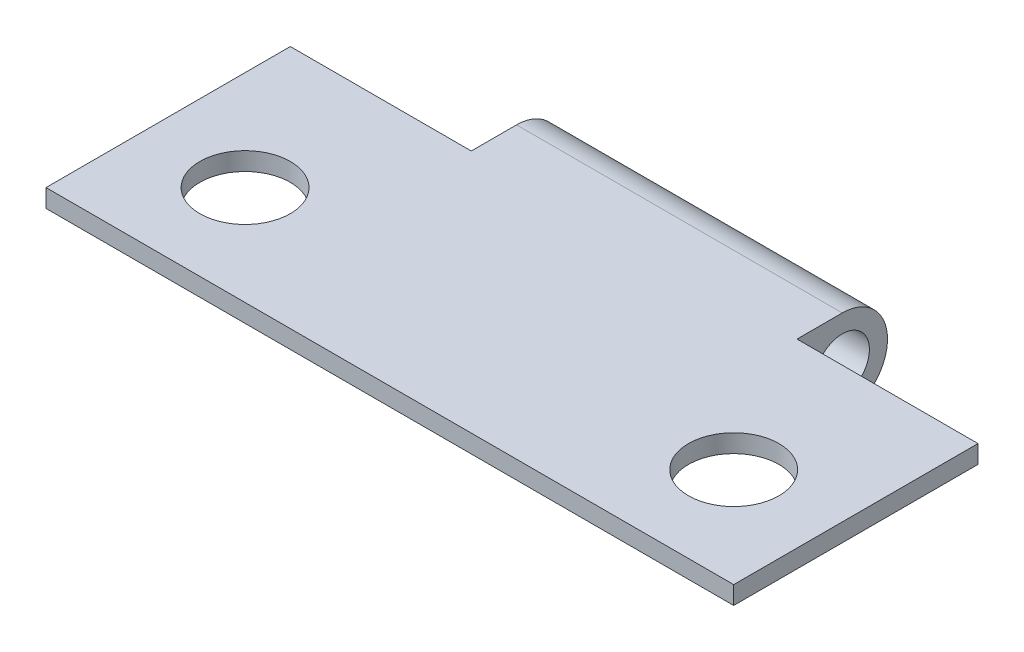
ISO-10303-21;
HEADER;
FILE_DESCRIPTION(('STEP AP214'),'2;1');
FILE_NAME('part.step','',(''),(''),'','','');
FILE_SCHEMA(('AUTOMOTIVE_DESIGN { 1 0 10303 214 1 1 1 1 }'));
ENDSEC;
DATA;
#1=APPLICATION_CONTEXT('core data for automotive mechanical design processes');
#2=APPLICATION_PROTOCOL_DEFINITION('international standard','automotive_design',2000,#1);
#3=PRODUCT_CONTEXT('',#1,'mechanical');
#4=PRODUCT('Part','Part','',(#3));
#5=PRODUCT_RELATED_PRODUCT_CATEGORY('part','',(#4));
#6=PRODUCT_DEFINITION_FORMATION('','',#4);
#7=PRODUCT_DEFINITION_CONTEXT('part definition',#1,'design');
#8=PRODUCT_DEFINITION('design','',#6,#7);
#9=PRODUCT_DEFINITION_SHAPE('','',#8);
#10=(LENGTH_UNIT() NAMED_UNIT(*) SI_UNIT(.MILLI.,.METRE.));
#11=(NAMED_UNIT(*) PLANE_ANGLE_UNIT() SI_UNIT($,.RADIAN.));
#12=(NAMED_UNIT(*) SI_UNIT($,.STERADIAN.) SOLID_ANGLE_UNIT());
#13=UNCERTAINTY_MEASURE_WITH_UNIT(LENGTH_MEASURE(1.E-05),#10,'distance_accuracy_value','');
#14=(GEOMETRIC_REPRESENTATION_CONTEXT(3) GLOBAL_UNCERTAINTY_ASSIGNED_CONTEXT((#13)) GLOBAL_UNIT_ASSIGNED_CONTEXT((#10,
#11,#12)) REPRESENTATION_CONTEXT('',''));
#15=CARTESIAN_POINT('',(0.,0.,0.));
#16=DIRECTION('',(0.,0.,1.));
#17=DIRECTION('',(1.,0.,0.));
#18=AXIS2_PLACEMENT_3D('',#15,#16,#17);
#19=CARTESIAN_POINT('',(38.,-1.50000000000001,-16.));
#20=DIRECTION('',(-1.,0.,0.));
#21=DIRECTION('',(0.,0.,1.));
#22=AXIS2_PLACEMENT_3D('',#19,#20,#21);
#23=PLANE('',#22);
#24=DIRECTION('',(0.,0.,-1.));
#25=VECTOR('',#24,1.);
#26=CARTESIAN_POINT('',(38.,0.,0.));
#27=LINE('',#26,#25);
#28=CARTESIAN_POINT('',(38.,0.,0.));
#29=VERTEX_POINT('',#28);
#30=CARTESIAN_POINT('',(38.,0.,-13.5));
#31=VERTEX_POINT('',#30);
#32=EDGE_CURVE('E128',#29,#31,#27,.T.);
#33=ORIENTED_EDGE('',*,*,#32,.T.);
#34=DIRECTION('',(0.,1.,0.));
#35=VECTOR('',#34,1.);
#36=CARTESIAN_POINT('',(38.,-4.00000000000002,-13.5));
#37=LINE('',#36,#35);
#38=CARTESIAN_POINT('',(38.,0.999999999999999,-13.5));
#39=VERTEX_POINT('',#38);
#40=EDGE_CURVE('E141',#31,#39,#37,.T.);
#41=ORIENTED_EDGE('',*,*,#40,.T.);
#42=DIRECTION('',(0.,0.,1.));
#43=VECTOR('',#42,1.);
#44=CARTESIAN_POINT('',(38.,0.999999999999999,-16.));
#45=LINE('',#44,#43);
#46=CARTESIAN_POINT('',(38.,1.,0.));
#47=VERTEX_POINT('',#46);
#48=EDGE_CURVE('E136',#39,#47,#45,.T.);
#49=ORIENTED_EDGE('',*,*,#48,.T.);
#50=DIRECTION('',(0.,-1.,0.));
#51=VECTOR('',#50,1.);
#52=CARTESIAN_POINT('',(38.,0.,0.));
#53=LINE('',#52,#51);
#54=EDGE_CURVE('E124',#47,#29,#53,.T.);
#55=ORIENTED_EDGE('',*,*,#54,.T.);
#56=EDGE_LOOP('',(#33,#41,#49,#55));
#57=FACE_BOUND('',#56,.T.);
#58=ADVANCED_FACE('F33',(#57),#23,.F.);
#59=CARTESIAN_POINT('',(0.,-1.50000000000001,-16.));
#60=DIRECTION('',(-1.,0.,0.));
#61=DIRECTION('',(0.,0.,1.));
#62=AXIS2_PLACEMENT_3D('',#59,#60,#61);
#63=PLANE('',#62);
#64=DIRECTION('',(0.,1.,0.));
#65=VECTOR('',#64,1.);
#66=CARTESIAN_POINT('',(0.,-4.00000000000002,-13.5));
#67=LINE('',#66,#65);
#68=CARTESIAN_POINT('',(0.,0.,-13.5));
#69=VERTEX_POINT('',#68);
#70=CARTESIAN_POINT('',(0.,0.999999999999999,-13.5));
#71=VERTEX_POINT('',#70);
#72=EDGE_CURVE('E100',#69,#71,#67,.T.);
#73=ORIENTED_EDGE('',*,*,#72,.F.);
#74=DIRECTION('',(0.,0.,-1.));
#75=VECTOR('',#74,1.);
#76=CARTESIAN_POINT('',(0.,0.,0.));
#77=LINE('',#76,#75);
#78=CARTESIAN_POINT('',(0.,0.,0.));
#79=VERTEX_POINT('',#78);
#80=EDGE_CURVE('E125',#79,#69,#77,.T.);
#81=ORIENTED_EDGE('',*,*,#80,.F.);
#82=DIRECTION('',(0.,-1.,0.));
#83=VECTOR('',#82,1.);
#84=CARTESIAN_POINT('',(0.,0.,0.));
#85=LINE('',#84,#83);
#86=CARTESIAN_POINT('',(0.,1.,0.));
#87=VERTEX_POINT('',#86);
#88=EDGE_CURVE('E123',#87,#79,#85,.T.);
#89=ORIENTED_EDGE('',*,*,#88,.F.);
#90=DIRECTION('',(0.,0.,1.));
#91=VECTOR('',#90,1.);
#92=CARTESIAN_POINT('',(0.,0.999999999999999,-16.));
#93=LINE('',#92,#91);
#94=EDGE_CURVE('E113',#71,#87,#93,.T.);
#95=ORIENTED_EDGE('',*,*,#94,.F.);
#96=EDGE_LOOP('',(#73,#81,#89,#95));
#97=FACE_BOUND('',#96,.T.);
#98=ADVANCED_FACE('F121',(#97),#63,.T.);
#99=CARTESIAN_POINT('',(38.,0.,0.));
#100=DIRECTION('',(0.,0.,-1.));
#101=DIRECTION('',(-1.,0.,0.));
#102=AXIS2_PLACEMENT_3D('',#99,#100,#101);
#103=PLANE('',#102);
#104=ORIENTED_EDGE('',*,*,#88,.T.);
#105=DIRECTION('',(-1.,0.,0.));
#106=VECTOR('',#105,1.);
#107=CARTESIAN_POINT('',(38.,0.,0.));
#108=LINE('',#107,#106);
#109=EDGE_CURVE('E11',#29,#79,#108,.T.);
#110=ORIENTED_EDGE('',*,*,#109,.F.);
#111=ORIENTED_EDGE('',*,*,#54,.F.);
#112=DIRECTION('',(-1.,0.,0.));
#113=VECTOR('',#112,1.);
#114=CARTESIAN_POINT('',(38.,1.,0.));
#115=LINE('',#114,#113);
#116=EDGE_CURVE('E133',#47,#87,#115,.T.);
#117=ORIENTED_EDGE('',*,*,#116,.T.);
#118=EDGE_LOOP('',(#104,#110,#111,#117));
#119=FACE_BOUND('',#118,.T.);
#120=ADVANCED_FACE('F35',(#119),#103,.F.);
#121=CARTESIAN_POINT('',(38.,0.,0.));
#122=DIRECTION('',(0.,1.,0.));
#123=DIRECTION('',(0.,0.,1.));
#124=AXIS2_PLACEMENT_3D('',#121,#122,#123);
#125=PLANE('',#124);
#126=CARTESIAN_POINT('',(32.5,0.,-5.5));
#127=DIRECTION('',(0.,1.,0.));
#128=DIRECTION('',(0.,0.,1.));
#129=AXIS2_PLACEMENT_3D('',#126,#127,#128);
#130=CIRCLE('',#129,2.5);
#131=CARTESIAN_POINT('',(32.5,0.,-3.));
#132=VERTEX_POINT('',#131);
#133=EDGE_CURVE('E190',#132,#132,#130,.T.);
#134=ORIENTED_EDGE('',*,*,#133,.T.);
#135=EDGE_LOOP('',(#134));
#136=FACE_BOUND('',#135,.T.);
#137=CARTESIAN_POINT('',(5.5,0.,-5.5));
#138=DIRECTION('',(0.,1.,0.));
#139=DIRECTION('',(0.,0.,1.));
#140=AXIS2_PLACEMENT_3D('',#137,#138,#139);
#141=CIRCLE('',#140,2.5);
#142=CARTESIAN_POINT('',(5.5,0.,-3.));
#143=VERTEX_POINT('',#142);
#144=EDGE_CURVE('E118',#143,#143,#141,.T.);
#145=ORIENTED_EDGE('',*,*,#144,.T.);
#146=EDGE_LOOP('',(#145));
#147=FACE_BOUND('',#146,.T.);
#148=ORIENTED_EDGE('',*,*,#80,.T.);
#149=DIRECTION('',(1.,0.,0.));
#150=VECTOR('',#149,1.);
#151=CARTESIAN_POINT('',(38.,0.,-13.5));
#152=LINE('',#151,#150);
#153=CARTESIAN_POINT('',(10.,0.,-13.5));
#154=VERTEX_POINT('',#153);
#155=EDGE_CURVE('E103',#69,#154,#152,.T.);
#156=ORIENTED_EDGE('',*,*,#155,.T.);
#157=DIRECTION('',(0.,0.,-1.));
#158=VECTOR('',#157,1.);
#159=CARTESIAN_POINT('',(10.,0.,0.));
#160=LINE('',#159,#158);
#161=CARTESIAN_POINT('',(10.,0.,-14.));
#162=VERTEX_POINT('',#161);
#163=EDGE_CURVE('E176',#154,#162,#160,.T.);
#164=ORIENTED_EDGE('',*,*,#163,.T.);
#165=DIRECTION('',(-1.,0.,0.));
#166=VECTOR('',#165,1.);
#167=CARTESIAN_POINT('',(38.,0.,-14.));
#168=LINE('',#167,#166);
#169=CARTESIAN_POINT('',(28.,0.,-14.));
#170=VERTEX_POINT('',#169);
#171=EDGE_CURVE('E42',#170,#162,#168,.T.);
#172=ORIENTED_EDGE('',*,*,#171,.F.);
#173=DIRECTION('',(0.,0.,1.));
#174=VECTOR('',#173,1.);
#175=CARTESIAN_POINT('',(28.,0.,0.));
#176=LINE('',#175,#174);
#177=CARTESIAN_POINT('',(28.,0.,-13.5));
#178=VERTEX_POINT('',#177);
#179=EDGE_CURVE('E144',#170,#178,#176,.T.);
#180=ORIENTED_EDGE('',*,*,#179,.T.);
#181=DIRECTION('',(1.,0.,0.));
#182=VECTOR('',#181,1.);
#183=CARTESIAN_POINT('',(38.,0.,-13.5));
#184=LINE('',#183,#182);
#185=EDGE_CURVE('E159',#178,#31,#184,.T.);
#186=ORIENTED_EDGE('',*,*,#185,.T.);
#187=ORIENTED_EDGE('',*,*,#32,.F.);
#188=ORIENTED_EDGE('',*,*,#109,.T.);
#189=EDGE_LOOP('',(#148,#156,#164,#172,#180,#186,#187,#188));
#190=FACE_BOUND('',#189,.T.);
#191=ADVANCED_FACE('F168',(#136,#147,#190),#125,.F.);
#192=CARTESIAN_POINT('',(38.,-1.50000000000001,-16.));
#193=DIRECTION('',(-1.,0.,0.));
#194=DIRECTION('',(0.,0.,1.));
#195=AXIS2_PLACEMENT_3D('',#192,#193,#194);
#196=CYLINDRICAL_SURFACE('',#195,2.50000000000001);
#197=ORIENTED_EDGE('',*,*,#171,.T.);
#198=CARTESIAN_POINT('',(10.,-1.50000000000001,-16.));
#199=DIRECTION('',(1.,0.,0.));
#200=DIRECTION('',(0.,0.,-1.));
#201=AXIS2_PLACEMENT_3D('',#198,#199,#200);
#202=CIRCLE('',#201,2.50000000000001);
#203=CARTESIAN_POINT('',(10.,0.999999999999999,-16.));
#204=VERTEX_POINT('',#203);
#205=EDGE_CURVE('E181',#162,#204,#202,.T.);
#206=ORIENTED_EDGE('',*,*,#205,.T.);
#207=DIRECTION('',(-1.,0.,0.));
#208=VECTOR('',#207,1.);
#209=CARTESIAN_POINT('',(38.,0.999999999999998,-16.));
#210=LINE('',#209,#208);
#211=CARTESIAN_POINT('',(28.,0.999999999999998,-16.));
#212=VERTEX_POINT('',#211);
#213=EDGE_CURVE('E135',#212,#204,#210,.T.);
#214=ORIENTED_EDGE('',*,*,#213,.F.);
#215=CARTESIAN_POINT('',(28.,-1.50000000000001,-16.));
#216=DIRECTION('',(-1.,0.,0.));
#217=DIRECTION('',(0.,0.,1.));
#218=AXIS2_PLACEMENT_3D('',#215,#216,#217);
#219=CIRCLE('',#218,2.50000000000001);
#220=EDGE_CURVE('E58',#212,#170,#219,.T.);
#221=ORIENTED_EDGE('',*,*,#220,.T.);
#222=EDGE_LOOP('',(#197,#206,#214,#221));
#223=FACE_BOUND('',#222,.T.);
#224=ADVANCED_FACE('F203',(#223),#196,.T.);
#225=CARTESIAN_POINT('',(38.,0.999999999999999,-16.));
#226=DIRECTION('',(0.,-1.,0.));
#227=DIRECTION('',(0.,0.,-1.));
#228=AXIS2_PLACEMENT_3D('',#225,#226,#227);
#229=PLANE('',#228);
#230=CARTESIAN_POINT('',(32.5,1.,-5.5));
#231=DIRECTION('',(0.,1.,0.));
#232=DIRECTION('',(0.,0.,-1.));
#233=AXIS2_PLACEMENT_3D('',#230,#231,#232);
#234=CIRCLE('',#233,2.5);
#235=CARTESIAN_POINT('',(32.5,0.999999999999999,-8.));
#236=VERTEX_POINT('',#235);
#237=EDGE_CURVE('E193',#236,#236,#234,.T.);
#238=ORIENTED_EDGE('',*,*,#237,.F.);
#239=EDGE_LOOP('',(#238));
#240=FACE_BOUND('',#239,.T.);
#241=CARTESIAN_POINT('',(5.5,1.,-5.5));
#242=DIRECTION('',(0.,1.,0.));
#243=DIRECTION('',(0.,0.,1.));
#244=AXIS2_PLACEMENT_3D('',#241,#242,#243);
#245=CIRCLE('',#244,2.5);
#246=CARTESIAN_POINT('',(5.5,1.,-3.));
#247=VERTEX_POINT('',#246);
#248=EDGE_CURVE('E187',#247,#247,#245,.T.);
#249=ORIENTED_EDGE('',*,*,#248,.F.);
#250=EDGE_LOOP('',(#249));
#251=FACE_BOUND('',#250,.T.);
#252=DIRECTION('',(0.,0.,-1.));
#253=VECTOR('',#252,1.);
#254=CARTESIAN_POINT('',(10.,0.999999999999999,-13.5));
#255=LINE('',#254,#253);
#256=CARTESIAN_POINT('',(10.,0.999999999999999,-13.5));
#257=VERTEX_POINT('',#256);
#258=EDGE_CURVE('E117',#257,#204,#255,.T.);
#259=ORIENTED_EDGE('',*,*,#258,.F.);
#260=DIRECTION('',(1.,0.,0.));
#261=VECTOR('',#260,1.);
#262=CARTESIAN_POINT('',(0.,0.999999999999999,-13.5));
#263=LINE('',#262,#261);
#264=EDGE_CURVE('E50',#71,#257,#263,.T.);
#265=ORIENTED_EDGE('',*,*,#264,.F.);
#266=ORIENTED_EDGE('',*,*,#94,.T.);
#267=ORIENTED_EDGE('',*,*,#116,.F.);
#268=ORIENTED_EDGE('',*,*,#48,.F.);
#269=DIRECTION('',(1.,0.,0.));
#270=VECTOR('',#269,1.);
#271=CARTESIAN_POINT('',(38.,0.999999999999999,-13.5));
#272=LINE('',#271,#270);
#273=CARTESIAN_POINT('',(28.,0.999999999999999,-13.5));
#274=VERTEX_POINT('',#273);
#275=EDGE_CURVE('E152',#274,#39,#272,.T.);
#276=ORIENTED_EDGE('',*,*,#275,.F.);
#277=DIRECTION('',(0.,0.,1.));
#278=VECTOR('',#277,1.);
#279=CARTESIAN_POINT('',(28.,0.999999999999999,-13.5));
#280=LINE('',#279,#278);
#281=EDGE_CURVE('E174',#212,#274,#280,.T.);
#282=ORIENTED_EDGE('',*,*,#281,.F.);
#283=ORIENTED_EDGE('',*,*,#213,.T.);
#284=EDGE_LOOP('',(#259,#265,#266,#267,#268,#276,#282,#283));
#285=FACE_BOUND('',#284,.T.);
#286=ADVANCED_FACE('F111',(#240,#251,#285),#229,.F.);
#287=CARTESIAN_POINT('',(38.,-1.5,-16.));
#288=DIRECTION('',(-1.,0.,0.));
#289=DIRECTION('',(0.,0.,1.));
#290=AXIS2_PLACEMENT_3D('',#287,#288,#289);
#291=CYLINDRICAL_SURFACE('',#290,1.5);
#292=CARTESIAN_POINT('',(10.,-1.5,-16.));
#293=DIRECTION('',(1.,0.,0.));
#294=DIRECTION('',(0.,0.,-1.));
#295=AXIS2_PLACEMENT_3D('',#292,#293,#294);
#296=CIRCLE('',#295,1.5);
#297=CARTESIAN_POINT('',(10.,-1.5,-17.5));
#298=VERTEX_POINT('',#297);
#299=EDGE_CURVE('E37',#298,#298,#296,.T.);
#300=ORIENTED_EDGE('',*,*,#299,.F.);
#301=EDGE_LOOP('',(#300));
#302=FACE_BOUND('',#301,.T.);
#303=CARTESIAN_POINT('',(28.,-1.5,-16.));
#304=DIRECTION('',(-1.,0.,0.));
#305=DIRECTION('',(0.,0.,1.));
#306=AXIS2_PLACEMENT_3D('',#303,#304,#305);
#307=CIRCLE('',#306,1.5);
#308=CARTESIAN_POINT('',(28.,-1.5,-14.5));
#309=VERTEX_POINT('',#308);
#310=EDGE_CURVE('E139',#309,#309,#307,.T.);
#311=ORIENTED_EDGE('',*,*,#310,.F.);
#312=EDGE_LOOP('',(#311));
#313=FACE_BOUND('',#312,.T.);
#314=ADVANCED_FACE('F202',(#302,#313),#291,.F.);
#315=CARTESIAN_POINT('',(38.,-4.00000000000002,-13.5));
#316=DIRECTION('',(0.,0.,1.));
#317=DIRECTION('',(1.,0.,0.));
#318=AXIS2_PLACEMENT_3D('',#315,#316,#317);
#319=PLANE('',#318);
#320=DIRECTION('',(0.,1.,0.));
#321=VECTOR('',#320,1.);
#322=CARTESIAN_POINT('',(28.,-4.00000000000002,-13.5));
#323=LINE('',#322,#321);
#324=EDGE_CURVE('E147',#178,#274,#323,.T.);
#325=ORIENTED_EDGE('',*,*,#324,.T.);
#326=ORIENTED_EDGE('',*,*,#275,.T.);
#327=ORIENTED_EDGE('',*,*,#40,.F.);
#328=ORIENTED_EDGE('',*,*,#185,.F.);
#329=EDGE_LOOP('',(#325,#326,#327,#328));
#330=FACE_BOUND('',#329,.T.);
#331=ADVANCED_FACE('F172',(#330),#319,.F.);
#332=CARTESIAN_POINT('',(28.,-4.00000000000002,-13.5));
#333=DIRECTION('',(-1.,0.,0.));
#334=DIRECTION('',(0.,0.,1.));
#335=AXIS2_PLACEMENT_3D('',#332,#333,#334);
#336=PLANE('',#335);
#337=ORIENTED_EDGE('',*,*,#310,.T.);
#338=EDGE_LOOP('',(#337));
#339=FACE_BOUND('',#338,.T.);
#340=ORIENTED_EDGE('',*,*,#220,.F.);
#341=ORIENTED_EDGE('',*,*,#281,.T.);
#342=ORIENTED_EDGE('',*,*,#324,.F.);
#343=ORIENTED_EDGE('',*,*,#179,.F.);
#344=EDGE_LOOP('',(#340,#341,#342,#343));
#345=FACE_BOUND('',#344,.T.);
#346=ADVANCED_FACE('F173',(#339,#345),#336,.F.);
#347=CARTESIAN_POINT('',(0.,-4.00000000000002,-13.5));
#348=DIRECTION('',(0.,0.,1.));
#349=DIRECTION('',(1.,0.,0.));
#350=AXIS2_PLACEMENT_3D('',#347,#348,#349);
#351=PLANE('',#350);
#352=ORIENTED_EDGE('',*,*,#72,.T.);
#353=ORIENTED_EDGE('',*,*,#264,.T.);
#354=DIRECTION('',(0.,1.,0.));
#355=VECTOR('',#354,1.);
#356=CARTESIAN_POINT('',(10.,-4.00000000000002,-13.5));
#357=LINE('',#356,#355);
#358=EDGE_CURVE('E107',#154,#257,#357,.T.);
#359=ORIENTED_EDGE('',*,*,#358,.F.);
#360=ORIENTED_EDGE('',*,*,#155,.F.);
#361=EDGE_LOOP('',(#352,#353,#359,#360));
#362=FACE_BOUND('',#361,.T.);
#363=ADVANCED_FACE('F101',(#362),#351,.F.);
#364=CARTESIAN_POINT('',(10.,-4.00000000000002,-13.5));
#365=DIRECTION('',(1.,0.,0.));
#366=DIRECTION('',(0.,0.,-1.));
#367=AXIS2_PLACEMENT_3D('',#364,#365,#366);
#368=PLANE('',#367);
#369=ORIENTED_EDGE('',*,*,#299,.T.);
#370=EDGE_LOOP('',(#369));
#371=FACE_BOUND('',#370,.T.);
#372=ORIENTED_EDGE('',*,*,#358,.T.);
#373=ORIENTED_EDGE('',*,*,#258,.T.);
#374=ORIENTED_EDGE('',*,*,#205,.F.);
#375=ORIENTED_EDGE('',*,*,#163,.F.);
#376=EDGE_LOOP('',(#372,#373,#374,#375));
#377=FACE_BOUND('',#376,.T.);
#378=ADVANCED_FACE('F210',(#371,#377),#368,.F.);
#379=CARTESIAN_POINT('',(5.5,-4.00000000000001,-5.5));
#380=DIRECTION('',(0.,1.,0.));
#381=DIRECTION('',(0.,0.,1.));
#382=AXIS2_PLACEMENT_3D('',#379,#380,#381);
#383=CYLINDRICAL_SURFACE('',#382,2.5);
#384=ORIENTED_EDGE('',*,*,#248,.T.);
#385=EDGE_LOOP('',(#384));
#386=FACE_BOUND('',#385,.T.);
#387=ORIENTED_EDGE('',*,*,#144,.F.);
#388=EDGE_LOOP('',(#387));
#389=FACE_BOUND('',#388,.T.);
#390=ADVANCED_FACE('F207',(#386,#389),#383,.F.);
#391=CARTESIAN_POINT('',(32.5,-4.00000000000001,-5.5));
#392=DIRECTION('',(0.,1.,0.));
#393=DIRECTION('',(0.,0.,1.));
#394=AXIS2_PLACEMENT_3D('',#391,#392,#393);
#395=CYLINDRICAL_SURFACE('',#394,2.5);
#396=ORIENTED_EDGE('',*,*,#237,.T.);
#397=EDGE_LOOP('',(#396));
#398=FACE_BOUND('',#397,.T.);
#399=ORIENTED_EDGE('',*,*,#133,.F.);
#400=EDGE_LOOP('',(#399));
#401=FACE_BOUND('',#400,.T.);
#402=ADVANCED_FACE('F197',(#398,#401),#395,.F.);
#403=CLOSED_SHELL('',(#58,#98,#120,#191,#224,#286,#314,#331,#346,#363,#378,#390,#402));
#404=MANIFOLD_SOLID_BREP('B2',#403);
#405=ADVANCED_BREP_SHAPE_REPRESENTATION('',(#18,#404),#14);
#406=SHAPE_DEFINITION_REPRESENTATION(#9,#405);
ENDSEC;
END-ISO-10303-21;
